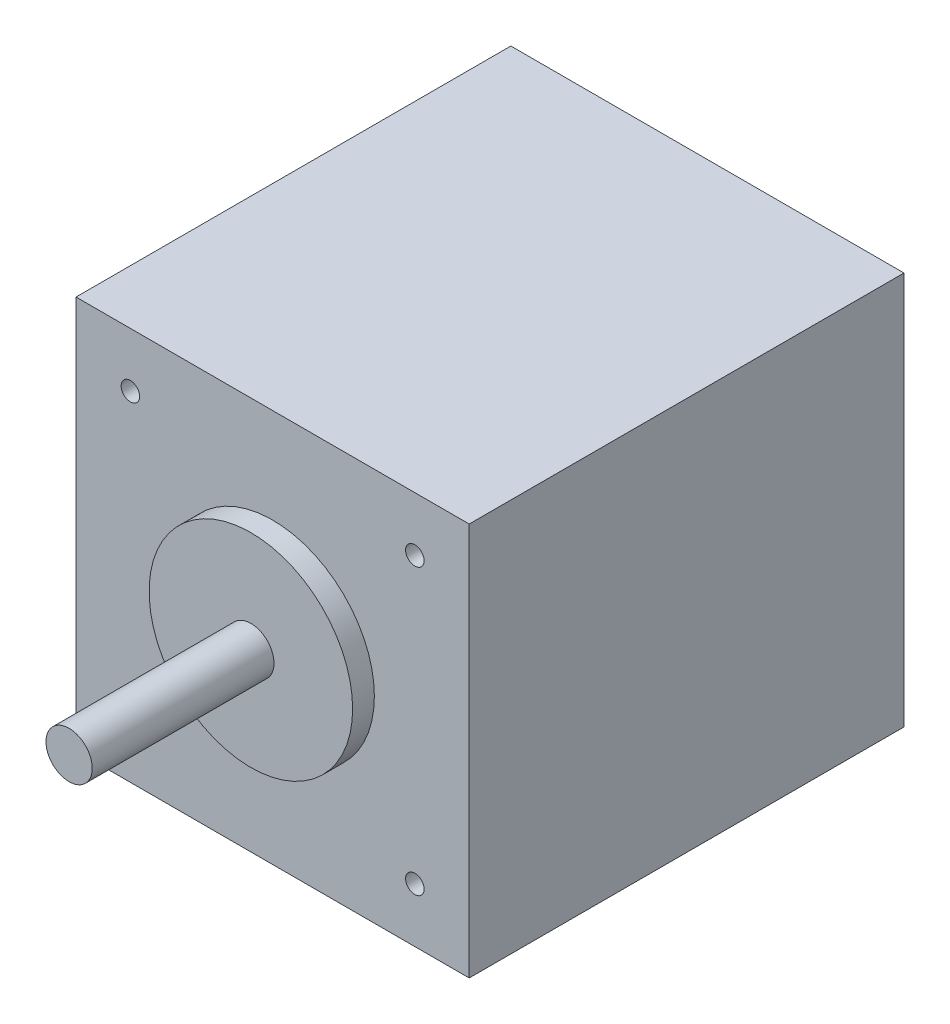
ISO-10303-21;
HEADER;
FILE_DESCRIPTION(('STEP AP214'),'2;1');
FILE_NAME('part.step','',(''),(''),'','','');
FILE_SCHEMA(('AUTOMOTIVE_DESIGN { 1 0 10303 214 1 1 1 1 }'));
ENDSEC;
DATA;
#1=APPLICATION_CONTEXT('core data for automotive mechanical design processes');
#2=APPLICATION_PROTOCOL_DEFINITION('international standard','automotive_design',2000,#1);
#3=PRODUCT_CONTEXT('',#1,'mechanical');
#4=PRODUCT('Part','Part','',(#3));
#5=PRODUCT_RELATED_PRODUCT_CATEGORY('part','',(#4));
#6=PRODUCT_DEFINITION_FORMATION('','',#4);
#7=PRODUCT_DEFINITION_CONTEXT('part definition',#1,'design');
#8=PRODUCT_DEFINITION('design','',#6,#7);
#9=PRODUCT_DEFINITION_SHAPE('','',#8);
#10=(LENGTH_UNIT() NAMED_UNIT(*) SI_UNIT(.MILLI.,.METRE.));
#11=(NAMED_UNIT(*) PLANE_ANGLE_UNIT() SI_UNIT($,.RADIAN.));
#12=(NAMED_UNIT(*) SI_UNIT($,.STERADIAN.) SOLID_ANGLE_UNIT());
#13=UNCERTAINTY_MEASURE_WITH_UNIT(LENGTH_MEASURE(1.E-05),#10,'distance_accuracy_value','');
#14=(GEOMETRIC_REPRESENTATION_CONTEXT(3) GLOBAL_UNCERTAINTY_ASSIGNED_CONTEXT((#13)) GLOBAL_UNIT_ASSIGNED_CONTEXT((#10,
#11,#12)) REPRESENTATION_CONTEXT('',''));
#15=CARTESIAN_POINT('',(0.,0.,0.));
#16=DIRECTION('',(0.,0.,1.));
#17=DIRECTION('',(1.,0.,0.));
#18=AXIS2_PLACEMENT_3D('',#15,#16,#17);
#19=CARTESIAN_POINT('',(21.25,21.25,47.));
#20=DIRECTION('',(-1.,0.,0.));
#21=DIRECTION('',(0.,-1.,0.));
#22=AXIS2_PLACEMENT_3D('',#19,#20,#21);
#23=PLANE('',#22);
#24=DIRECTION('',(0.,1.,0.));
#25=VECTOR('',#24,1.);
#26=CARTESIAN_POINT('',(21.25,21.25,0.));
#27=LINE('',#26,#25);
#28=CARTESIAN_POINT('',(21.25,-21.25,0.));
#29=VERTEX_POINT('',#28);
#30=CARTESIAN_POINT('',(21.25,21.25,0.));
#31=VERTEX_POINT('',#30);
#32=EDGE_CURVE('E100',#29,#31,#27,.T.);
#33=ORIENTED_EDGE('',*,*,#32,.T.);
#34=DIRECTION('',(0.,0.,-1.));
#35=VECTOR('',#34,1.);
#36=CARTESIAN_POINT('',(21.25,21.25,47.));
#37=LINE('',#36,#35);
#38=CARTESIAN_POINT('',(21.25,21.25,47.));
#39=VERTEX_POINT('',#38);
#40=EDGE_CURVE('E11',#39,#31,#37,.T.);
#41=ORIENTED_EDGE('',*,*,#40,.F.);
#42=DIRECTION('',(0.,1.,0.));
#43=VECTOR('',#42,1.);
#44=CARTESIAN_POINT('',(21.25,21.25,47.));
#45=LINE('',#44,#43);
#46=CARTESIAN_POINT('',(21.25,-21.25,47.));
#47=VERTEX_POINT('',#46);
#48=EDGE_CURVE('E87',#47,#39,#45,.T.);
#49=ORIENTED_EDGE('',*,*,#48,.F.);
#50=DIRECTION('',(0.,0.,-1.));
#51=VECTOR('',#50,1.);
#52=CARTESIAN_POINT('',(21.25,-21.25,47.));
#53=LINE('',#52,#51);
#54=EDGE_CURVE('E96',#47,#29,#53,.T.);
#55=ORIENTED_EDGE('',*,*,#54,.T.);
#56=EDGE_LOOP('',(#33,#41,#49,#55));
#57=FACE_BOUND('',#56,.T.);
#58=ADVANCED_FACE('F35',(#57),#23,.F.);
#59=CARTESIAN_POINT('',(-21.25,21.25,47.));
#60=DIRECTION('',(0.,-1.,0.));
#61=DIRECTION('',(0.,0.,-1.));
#62=AXIS2_PLACEMENT_3D('',#59,#60,#61);
#63=PLANE('',#62);
#64=DIRECTION('',(-1.,0.,0.));
#65=VECTOR('',#64,1.);
#66=CARTESIAN_POINT('',(-21.25,21.25,0.));
#67=LINE('',#66,#65);
#68=CARTESIAN_POINT('',(-21.25,21.25,0.));
#69=VERTEX_POINT('',#68);
#70=EDGE_CURVE('E91',#31,#69,#67,.T.);
#71=ORIENTED_EDGE('',*,*,#70,.T.);
#72=DIRECTION('',(0.,0.,-1.));
#73=VECTOR('',#72,1.);
#74=CARTESIAN_POINT('',(-21.25,21.25,47.));
#75=LINE('',#74,#73);
#76=CARTESIAN_POINT('',(-21.25,21.25,47.));
#77=VERTEX_POINT('',#76);
#78=EDGE_CURVE('E44',#77,#69,#75,.T.);
#79=ORIENTED_EDGE('',*,*,#78,.F.);
#80=DIRECTION('',(-1.,0.,0.));
#81=VECTOR('',#80,1.);
#82=CARTESIAN_POINT('',(-21.25,21.25,47.));
#83=LINE('',#82,#81);
#84=EDGE_CURVE('E82',#39,#77,#83,.T.);
#85=ORIENTED_EDGE('',*,*,#84,.F.);
#86=ORIENTED_EDGE('',*,*,#40,.T.);
#87=EDGE_LOOP('',(#71,#79,#85,#86));
#88=FACE_BOUND('',#87,.T.);
#89=ADVANCED_FACE('F90',(#88),#63,.F.);
#90=CARTESIAN_POINT('',(-21.25,21.25,47.));
#91=DIRECTION('',(1.,0.,0.));
#92=DIRECTION('',(0.,1.,0.));
#93=AXIS2_PLACEMENT_3D('',#90,#91,#92);
#94=PLANE('',#93);
#95=DIRECTION('',(0.,-1.,0.));
#96=VECTOR('',#95,1.);
#97=CARTESIAN_POINT('',(-21.25,21.25,0.));
#98=LINE('',#97,#96);
#99=CARTESIAN_POINT('',(-21.25,-21.25,0.));
#100=VERTEX_POINT('',#99);
#101=EDGE_CURVE('E69',#69,#100,#98,.T.);
#102=ORIENTED_EDGE('',*,*,#101,.T.);
#103=DIRECTION('',(0.,0.,-1.));
#104=VECTOR('',#103,1.);
#105=CARTESIAN_POINT('',(-21.25,-21.25,47.));
#106=LINE('',#105,#104);
#107=CARTESIAN_POINT('',(-21.25,-21.25,47.));
#108=VERTEX_POINT('',#107);
#109=EDGE_CURVE('E92',#108,#100,#106,.T.);
#110=ORIENTED_EDGE('',*,*,#109,.F.);
#111=DIRECTION('',(0.,-1.,0.));
#112=VECTOR('',#111,1.);
#113=CARTESIAN_POINT('',(-21.25,21.25,47.));
#114=LINE('',#113,#112);
#115=EDGE_CURVE('E85',#77,#108,#114,.T.);
#116=ORIENTED_EDGE('',*,*,#115,.F.);
#117=ORIENTED_EDGE('',*,*,#78,.T.);
#118=EDGE_LOOP('',(#102,#110,#116,#117));
#119=FACE_BOUND('',#118,.T.);
#120=ADVANCED_FACE('F94',(#119),#94,.F.);
#121=CARTESIAN_POINT('',(-21.25,-21.25,47.));
#122=DIRECTION('',(0.,1.,0.));
#123=DIRECTION('',(0.,0.,1.));
#124=AXIS2_PLACEMENT_3D('',#121,#122,#123);
#125=PLANE('',#124);
#126=DIRECTION('',(1.,0.,0.));
#127=VECTOR('',#126,1.);
#128=CARTESIAN_POINT('',(-21.25,-21.25,0.));
#129=LINE('',#128,#127);
#130=EDGE_CURVE('E75',#100,#29,#129,.T.);
#131=ORIENTED_EDGE('',*,*,#130,.T.);
#132=ORIENTED_EDGE('',*,*,#54,.F.);
#133=DIRECTION('',(1.,0.,0.));
#134=VECTOR('',#133,1.);
#135=CARTESIAN_POINT('',(-21.25,-21.25,47.));
#136=LINE('',#135,#134);
#137=EDGE_CURVE('E52',#108,#47,#136,.T.);
#138=ORIENTED_EDGE('',*,*,#137,.F.);
#139=ORIENTED_EDGE('',*,*,#109,.T.);
#140=EDGE_LOOP('',(#131,#132,#138,#139));
#141=FACE_BOUND('',#140,.T.);
#142=ADVANCED_FACE('F108',(#141),#125,.F.);
#143=CARTESIAN_POINT('',(0.,0.,47.));
#144=DIRECTION('',(0.,0.,1.));
#145=DIRECTION('',(1.,0.,0.));
#146=AXIS2_PLACEMENT_3D('',#143,#144,#145);
#147=PLANE('',#146);
#148=CARTESIAN_POINT('',(0.,0.,47.));
#149=DIRECTION('',(0.,0.,1.));
#150=DIRECTION('',(1.,0.,0.));
#151=AXIS2_PLACEMENT_3D('',#148,#149,#150);
#152=CIRCLE('',#151,11.);
#153=CARTESIAN_POINT('',(11.,0.,47.));
#154=VERTEX_POINT('',#153);
#155=EDGE_CURVE('E140',#154,#154,#152,.T.);
#156=ORIENTED_EDGE('',*,*,#155,.F.);
#157=EDGE_LOOP('',(#156));
#158=FACE_BOUND('',#157,.T.);
#159=CARTESIAN_POINT('',(-15.375,-15.375,47.));
#160=DIRECTION('',(0.,0.,1.));
#161=DIRECTION('',(1.,0.,0.));
#162=AXIS2_PLACEMENT_3D('',#159,#160,#161);
#163=CIRCLE('',#162,0.999999999999999);
#164=CARTESIAN_POINT('',(-14.375,-15.375,47.));
#165=VERTEX_POINT('',#164);
#166=EDGE_CURVE('E120',#165,#165,#163,.T.);
#167=ORIENTED_EDGE('',*,*,#166,.F.);
#168=EDGE_LOOP('',(#167));
#169=FACE_BOUND('',#168,.T.);
#170=CARTESIAN_POINT('',(15.375,-15.375,47.));
#171=DIRECTION('',(0.,0.,1.));
#172=DIRECTION('',(1.,0.,0.));
#173=AXIS2_PLACEMENT_3D('',#170,#171,#172);
#174=CIRCLE('',#173,1.);
#175=CARTESIAN_POINT('',(16.375,-15.375,47.));
#176=VERTEX_POINT('',#175);
#177=EDGE_CURVE('E127',#176,#176,#174,.T.);
#178=ORIENTED_EDGE('',*,*,#177,.F.);
#179=EDGE_LOOP('',(#178));
#180=FACE_BOUND('',#179,.T.);
#181=CARTESIAN_POINT('',(15.375,15.375,47.));
#182=DIRECTION('',(0.,0.,1.));
#183=DIRECTION('',(1.,0.,0.));
#184=AXIS2_PLACEMENT_3D('',#181,#182,#183);
#185=CIRCLE('',#184,1.);
#186=CARTESIAN_POINT('',(16.375,15.375,47.));
#187=VERTEX_POINT('',#186);
#188=EDGE_CURVE('E133',#187,#187,#185,.T.);
#189=ORIENTED_EDGE('',*,*,#188,.F.);
#190=EDGE_LOOP('',(#189));
#191=FACE_BOUND('',#190,.T.);
#192=CARTESIAN_POINT('',(-15.375,15.375,47.));
#193=DIRECTION('',(0.,0.,1.));
#194=DIRECTION('',(1.,0.,0.));
#195=AXIS2_PLACEMENT_3D('',#192,#193,#194);
#196=CIRCLE('',#195,1.);
#197=CARTESIAN_POINT('',(-14.375,15.375,47.));
#198=VERTEX_POINT('',#197);
#199=EDGE_CURVE('E114',#198,#198,#196,.T.);
#200=ORIENTED_EDGE('',*,*,#199,.F.);
#201=EDGE_LOOP('',(#200));
#202=FACE_BOUND('',#201,.T.);
#203=ORIENTED_EDGE('',*,*,#48,.T.);
#204=ORIENTED_EDGE('',*,*,#84,.T.);
#205=ORIENTED_EDGE('',*,*,#115,.T.);
#206=ORIENTED_EDGE('',*,*,#137,.T.);
#207=EDGE_LOOP('',(#203,#204,#205,#206));
#208=FACE_BOUND('',#207,.T.);
#209=ADVANCED_FACE('F83',(#158,#169,#180,#191,#202,#208),#147,.T.);
#210=CARTESIAN_POINT('',(0.,0.,0.));
#211=DIRECTION('',(0.,0.,1.));
#212=DIRECTION('',(1.,0.,0.));
#213=AXIS2_PLACEMENT_3D('',#210,#211,#212);
#214=PLANE('',#213);
#215=ORIENTED_EDGE('',*,*,#32,.F.);
#216=ORIENTED_EDGE('',*,*,#130,.F.);
#217=ORIENTED_EDGE('',*,*,#101,.F.);
#218=ORIENTED_EDGE('',*,*,#70,.F.);
#219=EDGE_LOOP('',(#215,#216,#217,#218));
#220=FACE_BOUND('',#219,.T.);
#221=ADVANCED_FACE('F111',(#220),#214,.F.);
#222=CARTESIAN_POINT('',(-15.375,15.375,45.));
#223=DIRECTION('',(0.,0.,1.));
#224=DIRECTION('',(1.,0.,0.));
#225=AXIS2_PLACEMENT_3D('',#222,#223,#224);
#226=CYLINDRICAL_SURFACE('',#225,1.);
#227=CARTESIAN_POINT('',(-15.375,15.375,45.));
#228=DIRECTION('',(0.,0.,1.));
#229=DIRECTION('',(1.,0.,0.));
#230=AXIS2_PLACEMENT_3D('',#227,#228,#229);
#231=CIRCLE('',#230,1.);
#232=CARTESIAN_POINT('',(-14.375,15.375,45.));
#233=VERTEX_POINT('',#232);
#234=EDGE_CURVE('E103',#233,#233,#231,.T.);
#235=ORIENTED_EDGE('',*,*,#234,.F.);
#236=EDGE_LOOP('',(#235));
#237=FACE_BOUND('',#236,.T.);
#238=ORIENTED_EDGE('',*,*,#199,.T.);
#239=EDGE_LOOP('',(#238));
#240=FACE_BOUND('',#239,.T.);
#241=ADVANCED_FACE('F180',(#237,#240),#226,.F.);
#242=CARTESIAN_POINT('',(-15.375,15.375,45.));
#243=DIRECTION('',(0.,0.,1.));
#244=DIRECTION('',(1.,0.,0.));
#245=AXIS2_PLACEMENT_3D('',#242,#243,#244);
#246=PLANE('',#245);
#247=ORIENTED_EDGE('',*,*,#234,.T.);
#248=EDGE_LOOP('',(#247));
#249=FACE_BOUND('',#248,.T.);
#250=ADVANCED_FACE('F186',(#249),#246,.T.);
#251=CARTESIAN_POINT('',(15.375,15.375,45.));
#252=DIRECTION('',(0.,0.,1.));
#253=DIRECTION('',(1.,0.,0.));
#254=AXIS2_PLACEMENT_3D('',#251,#252,#253);
#255=CYLINDRICAL_SURFACE('',#254,1.);
#256=CARTESIAN_POINT('',(15.375,15.375,45.));
#257=DIRECTION('',(0.,0.,1.));
#258=DIRECTION('',(1.,0.,0.));
#259=AXIS2_PLACEMENT_3D('',#256,#257,#258);
#260=CIRCLE('',#259,1.);
#261=CARTESIAN_POINT('',(16.375,15.375,45.));
#262=VERTEX_POINT('',#261);
#263=EDGE_CURVE('E117',#262,#262,#260,.T.);
#264=ORIENTED_EDGE('',*,*,#263,.F.);
#265=EDGE_LOOP('',(#264));
#266=FACE_BOUND('',#265,.T.);
#267=ORIENTED_EDGE('',*,*,#188,.T.);
#268=EDGE_LOOP('',(#267));
#269=FACE_BOUND('',#268,.T.);
#270=ADVANCED_FACE('F190',(#266,#269),#255,.F.);
#271=CARTESIAN_POINT('',(15.375,15.375,45.));
#272=DIRECTION('',(0.,0.,1.));
#273=DIRECTION('',(1.,0.,0.));
#274=AXIS2_PLACEMENT_3D('',#271,#272,#273);
#275=PLANE('',#274);
#276=ORIENTED_EDGE('',*,*,#263,.T.);
#277=EDGE_LOOP('',(#276));
#278=FACE_BOUND('',#277,.T.);
#279=ADVANCED_FACE('F203',(#278),#275,.T.);
#280=CARTESIAN_POINT('',(15.375,-15.375,45.));
#281=DIRECTION('',(0.,0.,1.));
#282=DIRECTION('',(1.,0.,0.));
#283=AXIS2_PLACEMENT_3D('',#280,#281,#282);
#284=CYLINDRICAL_SURFACE('',#283,1.);
#285=CARTESIAN_POINT('',(15.375,-15.375,45.));
#286=DIRECTION('',(0.,0.,1.));
#287=DIRECTION('',(1.,0.,0.));
#288=AXIS2_PLACEMENT_3D('',#285,#286,#287);
#289=CIRCLE('',#288,1.);
#290=CARTESIAN_POINT('',(16.375,-15.375,45.));
#291=VERTEX_POINT('',#290);
#292=EDGE_CURVE('E130',#291,#291,#289,.T.);
#293=ORIENTED_EDGE('',*,*,#292,.F.);
#294=EDGE_LOOP('',(#293));
#295=FACE_BOUND('',#294,.T.);
#296=ORIENTED_EDGE('',*,*,#177,.T.);
#297=EDGE_LOOP('',(#296));
#298=FACE_BOUND('',#297,.T.);
#299=ADVANCED_FACE('F200',(#295,#298),#284,.F.);
#300=CARTESIAN_POINT('',(15.375,-15.375,45.));
#301=DIRECTION('',(0.,0.,1.));
#302=DIRECTION('',(1.,0.,0.));
#303=AXIS2_PLACEMENT_3D('',#300,#301,#302);
#304=PLANE('',#303);
#305=ORIENTED_EDGE('',*,*,#292,.T.);
#306=EDGE_LOOP('',(#305));
#307=FACE_BOUND('',#306,.T.);
#308=ADVANCED_FACE('F195',(#307),#304,.T.);
#309=CARTESIAN_POINT('',(-15.375,-15.375,45.));
#310=DIRECTION('',(0.,0.,1.));
#311=DIRECTION('',(1.,0.,0.));
#312=AXIS2_PLACEMENT_3D('',#309,#310,#311);
#313=CYLINDRICAL_SURFACE('',#312,0.999999999999999);
#314=CARTESIAN_POINT('',(-15.375,-15.375,45.));
#315=DIRECTION('',(0.,0.,1.));
#316=DIRECTION('',(1.,0.,0.));
#317=AXIS2_PLACEMENT_3D('',#314,#315,#316);
#318=CIRCLE('',#317,0.999999999999999);
#319=CARTESIAN_POINT('',(-14.375,-15.375,45.));
#320=VERTEX_POINT('',#319);
#321=EDGE_CURVE('E123',#320,#320,#318,.T.);
#322=ORIENTED_EDGE('',*,*,#321,.F.);
#323=EDGE_LOOP('',(#322));
#324=FACE_BOUND('',#323,.T.);
#325=ORIENTED_EDGE('',*,*,#166,.T.);
#326=EDGE_LOOP('',(#325));
#327=FACE_BOUND('',#326,.T.);
#328=ADVANCED_FACE('F192',(#324,#327),#313,.F.);
#329=CARTESIAN_POINT('',(-15.375,-15.375,45.));
#330=DIRECTION('',(0.,0.,1.));
#331=DIRECTION('',(1.,0.,0.));
#332=AXIS2_PLACEMENT_3D('',#329,#330,#331);
#333=PLANE('',#332);
#334=ORIENTED_EDGE('',*,*,#321,.T.);
#335=EDGE_LOOP('',(#334));
#336=FACE_BOUND('',#335,.T.);
#337=ADVANCED_FACE('F164',(#336),#333,.T.);
#338=CARTESIAN_POINT('',(0.,0.,49.35));
#339=DIRECTION('',(0.,0.,-1.));
#340=DIRECTION('',(-1.,0.,0.));
#341=AXIS2_PLACEMENT_3D('',#338,#339,#340);
#342=CYLINDRICAL_SURFACE('',#341,11.);
#343=CARTESIAN_POINT('',(0.,0.,49.35));
#344=DIRECTION('',(0.,0.,1.));
#345=DIRECTION('',(1.,0.,0.));
#346=AXIS2_PLACEMENT_3D('',#343,#344,#345);
#347=CIRCLE('',#346,11.);
#348=CARTESIAN_POINT('',(11.,0.,49.35));
#349=VERTEX_POINT('',#348);
#350=EDGE_CURVE('E143',#349,#349,#347,.T.);
#351=ORIENTED_EDGE('',*,*,#350,.F.);
#352=EDGE_LOOP('',(#351));
#353=FACE_BOUND('',#352,.T.);
#354=ORIENTED_EDGE('',*,*,#155,.T.);
#355=EDGE_LOOP('',(#354));
#356=FACE_BOUND('',#355,.T.);
#357=ADVANCED_FACE('F156',(#353,#356),#342,.T.);
#358=CARTESIAN_POINT('',(0.,0.,49.35));
#359=DIRECTION('',(0.,0.,1.));
#360=DIRECTION('',(1.,0.,0.));
#361=AXIS2_PLACEMENT_3D('',#358,#359,#360);
#362=PLANE('',#361);
#363=CARTESIAN_POINT('',(0.,0.,49.35));
#364=DIRECTION('',(0.,0.,1.));
#365=DIRECTION('',(1.,0.,0.));
#366=AXIS2_PLACEMENT_3D('',#363,#364,#365);
#367=CIRCLE('',#366,2.5);
#368=CARTESIAN_POINT('',(2.5,0.,49.35));
#369=VERTEX_POINT('',#368);
#370=EDGE_CURVE('E38',#369,#369,#367,.T.);
#371=ORIENTED_EDGE('',*,*,#370,.F.);
#372=EDGE_LOOP('',(#371));
#373=FACE_BOUND('',#372,.T.);
#374=ORIENTED_EDGE('',*,*,#350,.T.);
#375=EDGE_LOOP('',(#374));
#376=FACE_BOUND('',#375,.T.);
#377=ADVANCED_FACE('F153',(#373,#376),#362,.T.);
#378=CARTESIAN_POINT('',(0.,0.,69.));
#379=DIRECTION('',(0.,0.,1.));
#380=DIRECTION('',(1.,0.,0.));
#381=AXIS2_PLACEMENT_3D('',#378,#379,#380);
#382=PLANE('',#381);
#383=CARTESIAN_POINT('',(0.,0.,69.));
#384=DIRECTION('',(0.,0.,1.));
#385=DIRECTION('',(1.,0.,0.));
#386=AXIS2_PLACEMENT_3D('',#383,#384,#385);
#387=CIRCLE('',#386,2.5);
#388=CARTESIAN_POINT('',(2.5,0.,69.));
#389=VERTEX_POINT('',#388);
#390=EDGE_CURVE('E124',#389,#389,#387,.T.);
#391=ORIENTED_EDGE('',*,*,#390,.T.);
#392=EDGE_LOOP('',(#391));
#393=FACE_BOUND('',#392,.T.);
#394=ADVANCED_FACE('F155',(#393),#382,.T.);
#395=CARTESIAN_POINT('',(0.,0.,69.));
#396=DIRECTION('',(0.,0.,-1.));
#397=DIRECTION('',(-1.,0.,0.));
#398=AXIS2_PLACEMENT_3D('',#395,#396,#397);
#399=CYLINDRICAL_SURFACE('',#398,2.5);
#400=ORIENTED_EDGE('',*,*,#370,.T.);
#401=EDGE_LOOP('',(#400));
#402=FACE_BOUND('',#401,.T.);
#403=ORIENTED_EDGE('',*,*,#390,.F.);
#404=EDGE_LOOP('',(#403));
#405=FACE_BOUND('',#404,.T.);
#406=ADVANCED_FACE('F150',(#402,#405),#399,.T.);
#407=CLOSED_SHELL('',(#58,#89,#120,#142,#209,#221,#241,#250,#270,#279,#299,#308,#328,#337,#357,
#377,#394,#406));
#408=MANIFOLD_SOLID_BREP('B2',#407);
#409=ADVANCED_BREP_SHAPE_REPRESENTATION('',(#18,#408),#14);
#410=SHAPE_DEFINITION_REPRESENTATION(#9,#409);
ENDSEC;
END-ISO-10303-21;
